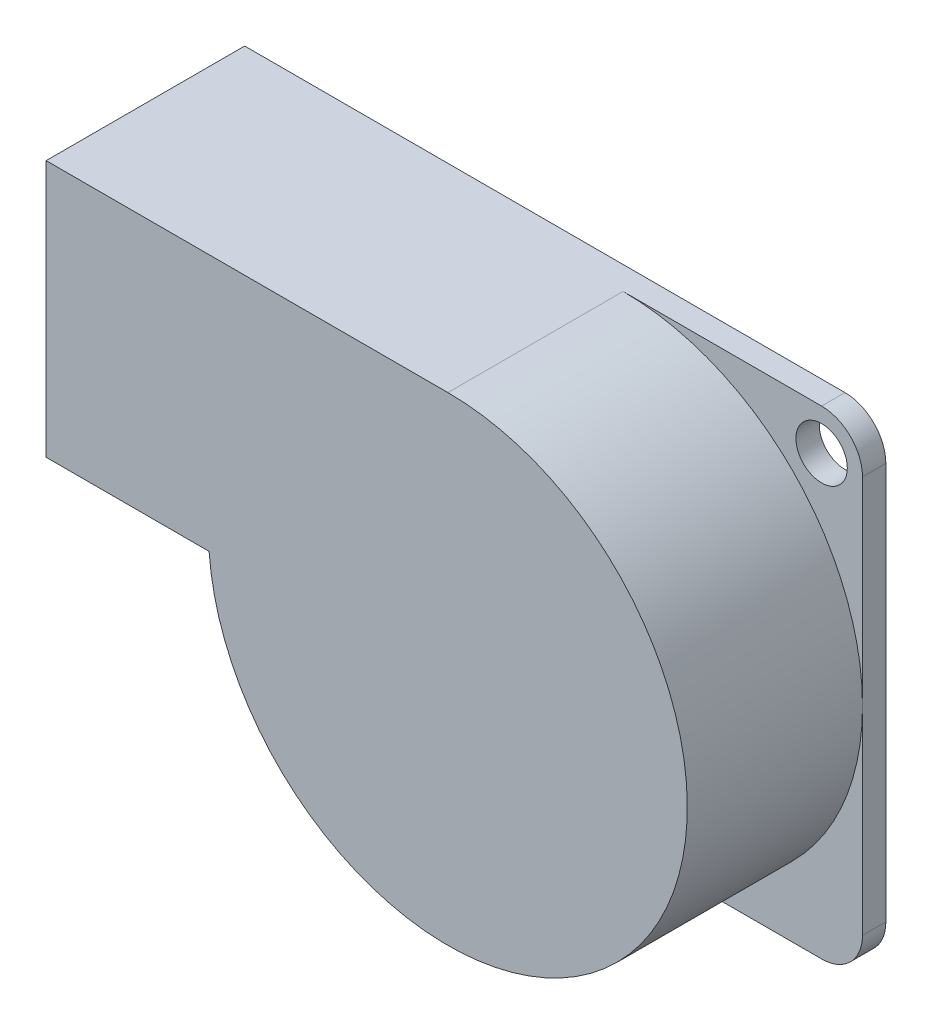
ISO-10303-21;
HEADER;
FILE_DESCRIPTION(('STEP AP214'),'2;1');
FILE_NAME('part.step','',(''),(''),'','','');
FILE_SCHEMA(('AUTOMOTIVE_DESIGN { 1 0 10303 214 1 1 1 1 }'));
ENDSEC;
DATA;
#1=APPLICATION_CONTEXT('core data for automotive mechanical design processes');
#2=APPLICATION_PROTOCOL_DEFINITION('international standard','automotive_design',2000,#1);
#3=PRODUCT_CONTEXT('',#1,'mechanical');
#4=PRODUCT('Part','Part','',(#3));
#5=PRODUCT_RELATED_PRODUCT_CATEGORY('part','',(#4));
#6=PRODUCT_DEFINITION_FORMATION('','',#4);
#7=PRODUCT_DEFINITION_CONTEXT('part definition',#1,'design');
#8=PRODUCT_DEFINITION('design','',#6,#7);
#9=PRODUCT_DEFINITION_SHAPE('','',#8);
#10=(LENGTH_UNIT() NAMED_UNIT(*) SI_UNIT(.MILLI.,.METRE.));
#11=(NAMED_UNIT(*) PLANE_ANGLE_UNIT() SI_UNIT($,.RADIAN.));
#12=(NAMED_UNIT(*) SI_UNIT($,.STERADIAN.) SOLID_ANGLE_UNIT());
#13=UNCERTAINTY_MEASURE_WITH_UNIT(LENGTH_MEASURE(1.E-05),#10,'distance_accuracy_value','');
#14=(GEOMETRIC_REPRESENTATION_CONTEXT(3) GLOBAL_UNCERTAINTY_ASSIGNED_CONTEXT((#13)) GLOBAL_UNIT_ASSIGNED_CONTEXT((#10,
#11,#12)) REPRESENTATION_CONTEXT('',''));
#15=CARTESIAN_POINT('',(0.,0.,0.));
#16=DIRECTION('',(0.,0.,1.));
#17=DIRECTION('',(1.,0.,0.));
#18=AXIS2_PLACEMENT_3D('',#15,#16,#17);
#19=CARTESIAN_POINT('',(-17.,-17.,1.));
#20=DIRECTION('',(0.,0.,1.));
#21=DIRECTION('',(1.,0.,0.));
#22=AXIS2_PLACEMENT_3D('',#19,#20,#21);
#23=PLANE('',#22);
#24=CARTESIAN_POINT('',(-8.5,-8.5,1.));
#25=DIRECTION('',(0.,0.,1.));
#26=DIRECTION('',(1.,0.,0.));
#27=AXIS2_PLACEMENT_3D('',#24,#25,#26);
#28=CIRCLE('',#27,10.25);
#29=CARTESIAN_POINT('',(1.75,-8.5,1.));
#30=VERTEX_POINT('',#29);
#31=CARTESIAN_POINT('',(-8.5,1.75,1.));
#32=VERTEX_POINT('',#31);
#33=EDGE_CURVE('E12',#30,#32,#28,.T.);
#34=ORIENTED_EDGE('',*,*,#33,.F.);
#35=DIRECTION('',(0.,1.,0.));
#36=VECTOR('',#35,1.);
#37=CARTESIAN_POINT('',(1.75,-17.,1.));
#38=LINE('',#37,#36);
#39=CARTESIAN_POINT('',(1.75,0.,1.));
#40=VERTEX_POINT('',#39);
#41=EDGE_CURVE('E175',#30,#40,#38,.T.);
#42=ORIENTED_EDGE('',*,*,#41,.T.);
#43=CARTESIAN_POINT('',(0.,0.,1.));
#44=DIRECTION('',(0.,0.,1.));
#45=DIRECTION('',(-1.,0.,0.));
#46=AXIS2_PLACEMENT_3D('',#43,#44,#45);
#47=CIRCLE('',#46,1.75);
#48=CARTESIAN_POINT('',(0.,1.75,1.));
#49=VERTEX_POINT('',#48);
#50=EDGE_CURVE('E179',#40,#49,#47,.T.);
#51=ORIENTED_EDGE('',*,*,#50,.T.);
#52=DIRECTION('',(-1.,0.,0.));
#53=VECTOR('',#52,1.);
#54=CARTESIAN_POINT('',(0.,1.75,1.));
#55=LINE('',#54,#53);
#56=EDGE_CURVE('E52',#49,#32,#55,.T.);
#57=ORIENTED_EDGE('',*,*,#56,.T.);
#58=EDGE_LOOP('',(#34,#42,#51,#57));
#59=FACE_BOUND('',#58,.T.);
#60=CARTESIAN_POINT('',(0.,0.,1.));
#61=DIRECTION('',(0.,0.,1.));
#62=DIRECTION('',(1.,0.,0.));
#63=AXIS2_PLACEMENT_3D('',#60,#61,#62);
#64=CIRCLE('',#63,1.1);
#65=CARTESIAN_POINT('',(1.1,0.,1.));
#66=VERTEX_POINT('',#65);
#67=EDGE_CURVE('E160',#66,#66,#64,.T.);
#68=ORIENTED_EDGE('',*,*,#67,.F.);
#69=EDGE_LOOP('',(#68));
#70=FACE_BOUND('',#69,.T.);
#71=ADVANCED_FACE('F35',(#59,#70),#23,.T.);
#72=CARTESIAN_POINT('',(-8.5,-18.75,1.));
#73=VERTEX_POINT('',#72);
#74=EDGE_CURVE('E44',#73,#30,#28,.T.);
#75=ORIENTED_EDGE('',*,*,#74,.F.);
#76=DIRECTION('',(1.,0.,0.));
#77=VECTOR('',#76,1.);
#78=CARTESIAN_POINT('',(-17.,-18.75,1.));
#79=LINE('',#78,#77);
#80=CARTESIAN_POINT('',(0.,-18.75,1.));
#81=VERTEX_POINT('',#80);
#82=EDGE_CURVE('E168',#73,#81,#79,.T.);
#83=ORIENTED_EDGE('',*,*,#82,.T.);
#84=CARTESIAN_POINT('',(0.,-17.,1.));
#85=DIRECTION('',(0.,0.,1.));
#86=DIRECTION('',(1.,0.,0.));
#87=AXIS2_PLACEMENT_3D('',#84,#85,#86);
#88=CIRCLE('',#87,1.75);
#89=CARTESIAN_POINT('',(1.75,-17.,1.));
#90=VERTEX_POINT('',#89);
#91=EDGE_CURVE('E173',#81,#90,#88,.T.);
#92=ORIENTED_EDGE('',*,*,#91,.T.);
#93=EDGE_CURVE('E176',#90,#30,#38,.T.);
#94=ORIENTED_EDGE('',*,*,#93,.T.);
#95=EDGE_LOOP('',(#75,#83,#92,#94));
#96=FACE_BOUND('',#95,.T.);
#97=ADVANCED_FACE('F280',(#96),#23,.T.);
#98=CARTESIAN_POINT('',(-18.7225241501304,-9.25,1.));
#99=VERTEX_POINT('',#98);
#100=EDGE_CURVE('E131',#99,#73,#28,.T.);
#101=ORIENTED_EDGE('',*,*,#100,.F.);
#102=DIRECTION('',(1.,0.,0.));
#103=VECTOR('',#102,1.);
#104=CARTESIAN_POINT('',(-25.7,-9.25,1.));
#105=LINE('',#104,#103);
#106=CARTESIAN_POINT('',(-18.75,-9.25,1.));
#107=VERTEX_POINT('',#106);
#108=EDGE_CURVE('E191',#107,#99,#105,.T.);
#109=ORIENTED_EDGE('',*,*,#108,.F.);
#110=DIRECTION('',(0.,-1.,0.));
#111=VECTOR('',#110,1.);
#112=CARTESIAN_POINT('',(-18.75,-9.25,1.));
#113=LINE('',#112,#111);
#114=CARTESIAN_POINT('',(-18.75,-17.,1.));
#115=VERTEX_POINT('',#114);
#116=EDGE_CURVE('E169',#107,#115,#113,.T.);
#117=ORIENTED_EDGE('',*,*,#116,.T.);
#118=CARTESIAN_POINT('',(-17.,-17.,1.));
#119=DIRECTION('',(0.,0.,1.));
#120=DIRECTION('',(1.,0.,0.));
#121=AXIS2_PLACEMENT_3D('',#118,#119,#120);
#122=CIRCLE('',#121,1.75);
#123=CARTESIAN_POINT('',(-17.,-18.75,1.));
#124=VERTEX_POINT('',#123);
#125=EDGE_CURVE('E166',#115,#124,#122,.T.);
#126=ORIENTED_EDGE('',*,*,#125,.T.);
#127=EDGE_CURVE('E170',#124,#73,#79,.T.);
#128=ORIENTED_EDGE('',*,*,#127,.T.);
#129=EDGE_LOOP('',(#101,#109,#117,#126,#128));
#130=FACE_BOUND('',#129,.T.);
#131=CARTESIAN_POINT('',(-17.,-17.,1.));
#132=DIRECTION('',(0.,0.,1.));
#133=DIRECTION('',(1.,0.,0.));
#134=AXIS2_PLACEMENT_3D('',#131,#132,#133);
#135=CIRCLE('',#134,1.1);
#136=CARTESIAN_POINT('',(-15.9,-17.,1.));
#137=VERTEX_POINT('',#136);
#138=EDGE_CURVE('E148',#137,#137,#135,.T.);
#139=ORIENTED_EDGE('',*,*,#138,.F.);
#140=EDGE_LOOP('',(#139));
#141=FACE_BOUND('',#140,.T.);
#142=ADVANCED_FACE('F282',(#130,#141),#23,.T.);
#143=CARTESIAN_POINT('',(-17.,-17.,0.));
#144=DIRECTION('',(0.,0.,1.));
#145=DIRECTION('',(1.,0.,0.));
#146=AXIS2_PLACEMENT_3D('',#143,#144,#145);
#147=PLANE('',#146);
#148=CARTESIAN_POINT('',(0.,0.,0.));
#149=DIRECTION('',(0.,0.,1.));
#150=DIRECTION('',(1.,0.,0.));
#151=AXIS2_PLACEMENT_3D('',#148,#149,#150);
#152=CIRCLE('',#151,1.1);
#153=CARTESIAN_POINT('',(1.1,0.,0.));
#154=VERTEX_POINT('',#153);
#155=EDGE_CURVE('E158',#154,#154,#152,.T.);
#156=ORIENTED_EDGE('',*,*,#155,.T.);
#157=EDGE_LOOP('',(#156));
#158=FACE_BOUND('',#157,.T.);
#159=DIRECTION('',(0.,-1.,0.));
#160=VECTOR('',#159,1.);
#161=CARTESIAN_POINT('',(-25.7,1.75,0.));
#162=LINE('',#161,#160);
#163=CARTESIAN_POINT('',(-25.7,1.75,0.));
#164=VERTEX_POINT('',#163);
#165=CARTESIAN_POINT('',(-25.7,-9.25,0.));
#166=VERTEX_POINT('',#165);
#167=EDGE_CURVE('E163',#164,#166,#162,.T.);
#168=ORIENTED_EDGE('',*,*,#167,.F.);
#169=DIRECTION('',(-1.,0.,0.));
#170=VECTOR('',#169,1.);
#171=CARTESIAN_POINT('',(0.,1.75,0.));
#172=LINE('',#171,#170);
#173=CARTESIAN_POINT('',(0.,1.75,0.));
#174=VERTEX_POINT('',#173);
#175=EDGE_CURVE('E201',#174,#164,#172,.T.);
#176=ORIENTED_EDGE('',*,*,#175,.F.);
#177=CARTESIAN_POINT('',(0.,0.,0.));
#178=DIRECTION('',(0.,0.,1.));
#179=DIRECTION('',(-1.,0.,0.));
#180=AXIS2_PLACEMENT_3D('',#177,#178,#179);
#181=CIRCLE('',#180,1.75);
#182=CARTESIAN_POINT('',(1.75,0.,0.));
#183=VERTEX_POINT('',#182);
#184=EDGE_CURVE('E206',#183,#174,#181,.T.);
#185=ORIENTED_EDGE('',*,*,#184,.F.);
#186=DIRECTION('',(0.,1.,0.));
#187=VECTOR('',#186,1.);
#188=CARTESIAN_POINT('',(1.75,-17.,0.));
#189=LINE('',#188,#187);
#190=CARTESIAN_POINT('',(1.75,-17.,0.));
#191=VERTEX_POINT('',#190);
#192=EDGE_CURVE('E210',#191,#183,#189,.T.);
#193=ORIENTED_EDGE('',*,*,#192,.F.);
#194=CARTESIAN_POINT('',(0.,-17.,0.));
#195=DIRECTION('',(0.,0.,1.));
#196=DIRECTION('',(1.,0.,0.));
#197=AXIS2_PLACEMENT_3D('',#194,#195,#196);
#198=CIRCLE('',#197,1.75);
#199=CARTESIAN_POINT('',(0.,-18.75,0.));
#200=VERTEX_POINT('',#199);
#201=EDGE_CURVE('E246',#200,#191,#198,.T.);
#202=ORIENTED_EDGE('',*,*,#201,.F.);
#203=DIRECTION('',(1.,0.,0.));
#204=VECTOR('',#203,1.);
#205=CARTESIAN_POINT('',(-17.,-18.75,0.));
#206=LINE('',#205,#204);
#207=CARTESIAN_POINT('',(-17.,-18.75,0.));
#208=VERTEX_POINT('',#207);
#209=EDGE_CURVE('E244',#208,#200,#206,.T.);
#210=ORIENTED_EDGE('',*,*,#209,.F.);
#211=CARTESIAN_POINT('',(-17.,-17.,0.));
#212=DIRECTION('',(0.,0.,1.));
#213=DIRECTION('',(1.,0.,0.));
#214=AXIS2_PLACEMENT_3D('',#211,#212,#213);
#215=CIRCLE('',#214,1.75);
#216=CARTESIAN_POINT('',(-18.75,-17.,0.));
#217=VERTEX_POINT('',#216);
#218=EDGE_CURVE('E234',#217,#208,#215,.T.);
#219=ORIENTED_EDGE('',*,*,#218,.F.);
#220=DIRECTION('',(0.,-1.,0.));
#221=VECTOR('',#220,1.);
#222=CARTESIAN_POINT('',(-18.75,-9.25,0.));
#223=LINE('',#222,#221);
#224=CARTESIAN_POINT('',(-18.75,-9.25,0.));
#225=VERTEX_POINT('',#224);
#226=EDGE_CURVE('E242',#225,#217,#223,.T.);
#227=ORIENTED_EDGE('',*,*,#226,.F.);
#228=DIRECTION('',(1.,0.,0.));
#229=VECTOR('',#228,1.);
#230=CARTESIAN_POINT('',(-25.7,-9.25,0.));
#231=LINE('',#230,#229);
#232=EDGE_CURVE('E248',#166,#225,#231,.T.);
#233=ORIENTED_EDGE('',*,*,#232,.F.);
#234=EDGE_LOOP('',(#168,#176,#185,#193,#202,#210,#219,#227,#233));
#235=FACE_BOUND('',#234,.T.);
#236=CARTESIAN_POINT('',(-17.,-17.,0.));
#237=DIRECTION('',(0.,0.,1.));
#238=DIRECTION('',(1.,0.,0.));
#239=AXIS2_PLACEMENT_3D('',#236,#237,#238);
#240=CIRCLE('',#239,1.1);
#241=CARTESIAN_POINT('',(-15.9,-17.,0.));
#242=VERTEX_POINT('',#241);
#243=EDGE_CURVE('E145',#242,#242,#240,.T.);
#244=ORIENTED_EDGE('',*,*,#243,.T.);
#245=EDGE_LOOP('',(#244));
#246=FACE_BOUND('',#245,.T.);
#247=ADVANCED_FACE('F240',(#158,#235,#246),#147,.F.);
#248=CARTESIAN_POINT('',(-25.7,1.75,1.));
#249=DIRECTION('',(1.,0.,0.));
#250=DIRECTION('',(0.,0.,-1.));
#251=AXIS2_PLACEMENT_3D('',#248,#249,#250);
#252=PLANE('',#251);
#253=ORIENTED_EDGE('',*,*,#167,.T.);
#254=DIRECTION('',(0.,0.,-1.));
#255=VECTOR('',#254,1.);
#256=CARTESIAN_POINT('',(-25.7,-9.25,1.));
#257=LINE('',#256,#255);
#258=CARTESIAN_POINT('',(-25.7,-9.25,8.5));
#259=VERTEX_POINT('',#258);
#260=EDGE_CURVE('E186',#259,#166,#257,.T.);
#261=ORIENTED_EDGE('',*,*,#260,.F.);
#262=DIRECTION('',(0.,-1.,0.));
#263=VECTOR('',#262,1.);
#264=CARTESIAN_POINT('',(-25.7,1.75,8.5));
#265=LINE('',#264,#263);
#266=CARTESIAN_POINT('',(-25.7,1.75,8.5));
#267=VERTEX_POINT('',#266);
#268=EDGE_CURVE('E139',#267,#259,#265,.T.);
#269=ORIENTED_EDGE('',*,*,#268,.F.);
#270=DIRECTION('',(0.,0.,-1.));
#271=VECTOR('',#270,1.);
#272=CARTESIAN_POINT('',(-25.7,1.75,1.));
#273=LINE('',#272,#271);
#274=EDGE_CURVE('E135',#267,#164,#273,.T.);
#275=ORIENTED_EDGE('',*,*,#274,.T.);
#276=EDGE_LOOP('',(#253,#261,#269,#275));
#277=FACE_BOUND('',#276,.T.);
#278=ADVANCED_FACE('F37',(#277),#252,.F.);
#279=CARTESIAN_POINT('',(-25.7,-9.25,1.));
#280=DIRECTION('',(0.,1.,0.));
#281=DIRECTION('',(0.,0.,1.));
#282=AXIS2_PLACEMENT_3D('',#279,#280,#281);
#283=PLANE('',#282);
#284=ORIENTED_EDGE('',*,*,#232,.T.);
#285=DIRECTION('',(0.,0.,-1.));
#286=VECTOR('',#285,1.);
#287=CARTESIAN_POINT('',(-18.75,-9.25,1.));
#288=LINE('',#287,#286);
#289=EDGE_CURVE('E194',#107,#225,#288,.T.);
#290=ORIENTED_EDGE('',*,*,#289,.F.);
#291=ORIENTED_EDGE('',*,*,#108,.T.);
#292=DIRECTION('',(0.,0.,-1.));
#293=VECTOR('',#292,1.);
#294=CARTESIAN_POINT('',(-18.7225241501304,-9.25,51.2600715118927));
#295=LINE('',#294,#293);
#296=CARTESIAN_POINT('',(-18.7225241501304,-9.25,8.5));
#297=VERTEX_POINT('',#296);
#298=EDGE_CURVE('E155',#297,#99,#295,.T.);
#299=ORIENTED_EDGE('',*,*,#298,.F.);
#300=DIRECTION('',(1.,0.,0.));
#301=VECTOR('',#300,1.);
#302=CARTESIAN_POINT('',(-25.7,-9.25,8.5));
#303=LINE('',#302,#301);
#304=EDGE_CURVE('E144',#259,#297,#303,.T.);
#305=ORIENTED_EDGE('',*,*,#304,.F.);
#306=ORIENTED_EDGE('',*,*,#260,.T.);
#307=EDGE_LOOP('',(#284,#290,#291,#299,#305,#306));
#308=FACE_BOUND('',#307,.T.);
#309=ADVANCED_FACE('F267',(#308),#283,.F.);
#310=CARTESIAN_POINT('',(-18.75,-9.25,1.));
#311=DIRECTION('',(1.,0.,0.));
#312=DIRECTION('',(0.,0.,-1.));
#313=AXIS2_PLACEMENT_3D('',#310,#311,#312);
#314=PLANE('',#313);
#315=ORIENTED_EDGE('',*,*,#226,.T.);
#316=DIRECTION('',(0.,0.,-1.));
#317=VECTOR('',#316,1.);
#318=CARTESIAN_POINT('',(-18.75,-17.,1.));
#319=LINE('',#318,#317);
#320=EDGE_CURVE('E197',#115,#217,#319,.T.);
#321=ORIENTED_EDGE('',*,*,#320,.F.);
#322=ORIENTED_EDGE('',*,*,#116,.F.);
#323=ORIENTED_EDGE('',*,*,#289,.T.);
#324=EDGE_LOOP('',(#315,#321,#322,#323));
#325=FACE_BOUND('',#324,.T.);
#326=ADVANCED_FACE('F268',(#325),#314,.F.);
#327=CARTESIAN_POINT('',(-17.,-17.,1.));
#328=DIRECTION('',(0.,0.,-1.));
#329=DIRECTION('',(-1.,0.,0.));
#330=AXIS2_PLACEMENT_3D('',#327,#328,#329);
#331=CYLINDRICAL_SURFACE('',#330,1.75);
#332=ORIENTED_EDGE('',*,*,#218,.T.);
#333=DIRECTION('',(0.,0.,-1.));
#334=VECTOR('',#333,1.);
#335=CARTESIAN_POINT('',(-17.,-18.75,1.));
#336=LINE('',#335,#334);
#337=EDGE_CURVE('E226',#124,#208,#336,.T.);
#338=ORIENTED_EDGE('',*,*,#337,.F.);
#339=ORIENTED_EDGE('',*,*,#125,.F.);
#340=ORIENTED_EDGE('',*,*,#320,.T.);
#341=EDGE_LOOP('',(#332,#338,#339,#340));
#342=FACE_BOUND('',#341,.T.);
#343=ADVANCED_FACE('F232',(#342),#331,.T.);
#344=CARTESIAN_POINT('',(-17.,-18.75,1.));
#345=DIRECTION('',(0.,1.,0.));
#346=DIRECTION('',(-1.,0.,0.));
#347=AXIS2_PLACEMENT_3D('',#344,#345,#346);
#348=PLANE('',#347);
#349=ORIENTED_EDGE('',*,*,#209,.T.);
#350=DIRECTION('',(0.,0.,-1.));
#351=VECTOR('',#350,1.);
#352=CARTESIAN_POINT('',(0.,-18.75,1.));
#353=LINE('',#352,#351);
#354=EDGE_CURVE('E223',#81,#200,#353,.T.);
#355=ORIENTED_EDGE('',*,*,#354,.F.);
#356=ORIENTED_EDGE('',*,*,#82,.F.);
#357=ORIENTED_EDGE('',*,*,#127,.F.);
#358=ORIENTED_EDGE('',*,*,#337,.T.);
#359=EDGE_LOOP('',(#349,#355,#356,#357,#358));
#360=FACE_BOUND('',#359,.T.);
#361=ADVANCED_FACE('F276',(#360),#348,.F.);
#362=CARTESIAN_POINT('',(0.,-17.,1.));
#363=DIRECTION('',(0.,0.,-1.));
#364=DIRECTION('',(-1.,0.,0.));
#365=AXIS2_PLACEMENT_3D('',#362,#363,#364);
#366=CYLINDRICAL_SURFACE('',#365,1.75);
#367=ORIENTED_EDGE('',*,*,#201,.T.);
#368=DIRECTION('',(0.,0.,-1.));
#369=VECTOR('',#368,1.);
#370=CARTESIAN_POINT('',(1.75,-17.,1.));
#371=LINE('',#370,#369);
#372=EDGE_CURVE('E220',#90,#191,#371,.T.);
#373=ORIENTED_EDGE('',*,*,#372,.F.);
#374=ORIENTED_EDGE('',*,*,#91,.F.);
#375=ORIENTED_EDGE('',*,*,#354,.T.);
#376=EDGE_LOOP('',(#367,#373,#374,#375));
#377=FACE_BOUND('',#376,.T.);
#378=ADVANCED_FACE('F373',(#377),#366,.T.);
#379=CARTESIAN_POINT('',(1.75,-17.,1.));
#380=DIRECTION('',(-1.,0.,0.));
#381=DIRECTION('',(0.,-1.,0.));
#382=AXIS2_PLACEMENT_3D('',#379,#380,#381);
#383=PLANE('',#382);
#384=ORIENTED_EDGE('',*,*,#192,.T.);
#385=DIRECTION('',(0.,0.,-1.));
#386=VECTOR('',#385,1.);
#387=CARTESIAN_POINT('',(1.75,0.,1.));
#388=LINE('',#387,#386);
#389=EDGE_CURVE('E217',#40,#183,#388,.T.);
#390=ORIENTED_EDGE('',*,*,#389,.F.);
#391=ORIENTED_EDGE('',*,*,#41,.F.);
#392=ORIENTED_EDGE('',*,*,#93,.F.);
#393=ORIENTED_EDGE('',*,*,#372,.T.);
#394=EDGE_LOOP('',(#384,#390,#391,#392,#393));
#395=FACE_BOUND('',#394,.T.);
#396=ADVANCED_FACE('F254',(#395),#383,.F.);
#397=CARTESIAN_POINT('',(0.,0.,1.));
#398=DIRECTION('',(0.,0.,-1.));
#399=DIRECTION('',(-1.,0.,0.));
#400=AXIS2_PLACEMENT_3D('',#397,#398,#399);
#401=CYLINDRICAL_SURFACE('',#400,1.75);
#402=ORIENTED_EDGE('',*,*,#184,.T.);
#403=DIRECTION('',(0.,0.,-1.));
#404=VECTOR('',#403,1.);
#405=CARTESIAN_POINT('',(0.,1.75,1.));
#406=LINE('',#405,#404);
#407=EDGE_CURVE('E215',#49,#174,#406,.T.);
#408=ORIENTED_EDGE('',*,*,#407,.F.);
#409=ORIENTED_EDGE('',*,*,#50,.F.);
#410=ORIENTED_EDGE('',*,*,#389,.T.);
#411=EDGE_LOOP('',(#402,#408,#409,#410));
#412=FACE_BOUND('',#411,.T.);
#413=ADVANCED_FACE('F260',(#412),#401,.T.);
#414=CARTESIAN_POINT('',(0.,1.75,1.));
#415=DIRECTION('',(0.,-1.,0.));
#416=DIRECTION('',(1.,0.,0.));
#417=AXIS2_PLACEMENT_3D('',#414,#415,#416);
#418=PLANE('',#417);
#419=ORIENTED_EDGE('',*,*,#175,.T.);
#420=ORIENTED_EDGE('',*,*,#274,.F.);
#421=DIRECTION('',(-1.,0.,0.));
#422=VECTOR('',#421,1.);
#423=CARTESIAN_POINT('',(-8.5,1.75,8.5));
#424=LINE('',#423,#422);
#425=CARTESIAN_POINT('',(-8.5,1.75,8.5));
#426=VERTEX_POINT('',#425);
#427=EDGE_CURVE('E130',#426,#267,#424,.T.);
#428=ORIENTED_EDGE('',*,*,#427,.F.);
#429=DIRECTION('',(0.,0.,-1.));
#430=VECTOR('',#429,1.);
#431=CARTESIAN_POINT('',(-8.5,1.75,51.2600715118927));
#432=LINE('',#431,#430);
#433=EDGE_CURVE('E121',#426,#32,#432,.T.);
#434=ORIENTED_EDGE('',*,*,#433,.T.);
#435=ORIENTED_EDGE('',*,*,#56,.F.);
#436=ORIENTED_EDGE('',*,*,#407,.T.);
#437=EDGE_LOOP('',(#419,#420,#428,#434,#435,#436));
#438=FACE_BOUND('',#437,.T.);
#439=ADVANCED_FACE('F133',(#438),#418,.F.);
#440=CARTESIAN_POINT('',(0.,0.,1.));
#441=DIRECTION('',(0.,0.,-1.));
#442=DIRECTION('',(-1.,0.,0.));
#443=AXIS2_PLACEMENT_3D('',#440,#441,#442);
#444=CYLINDRICAL_SURFACE('',#443,1.1);
#445=ORIENTED_EDGE('',*,*,#67,.T.);
#446=EDGE_LOOP('',(#445));
#447=FACE_BOUND('',#446,.T.);
#448=ORIENTED_EDGE('',*,*,#155,.F.);
#449=EDGE_LOOP('',(#448));
#450=FACE_BOUND('',#449,.T.);
#451=ADVANCED_FACE('F304',(#447,#450),#444,.F.);
#452=CARTESIAN_POINT('',(-17.,-17.,1.));
#453=DIRECTION('',(0.,0.,-1.));
#454=DIRECTION('',(-1.,0.,0.));
#455=AXIS2_PLACEMENT_3D('',#452,#453,#454);
#456=CYLINDRICAL_SURFACE('',#455,1.1);
#457=ORIENTED_EDGE('',*,*,#138,.T.);
#458=EDGE_LOOP('',(#457));
#459=FACE_BOUND('',#458,.T.);
#460=ORIENTED_EDGE('',*,*,#243,.F.);
#461=EDGE_LOOP('',(#460));
#462=FACE_BOUND('',#461,.T.);
#463=ADVANCED_FACE('F301',(#459,#462),#456,.F.);
#464=CARTESIAN_POINT('',(-8.5,-8.5,51.2600715118927));
#465=DIRECTION('',(0.,0.,-1.));
#466=DIRECTION('',(-1.,0.,0.));
#467=AXIS2_PLACEMENT_3D('',#464,#465,#466);
#468=CYLINDRICAL_SURFACE('',#467,10.25);
#469=CARTESIAN_POINT('',(-8.5,-8.5,8.5));
#470=DIRECTION('',(0.,0.,1.));
#471=DIRECTION('',(1.,0.,0.));
#472=AXIS2_PLACEMENT_3D('',#469,#470,#471);
#473=CIRCLE('',#472,10.25);
#474=EDGE_CURVE('E126',#297,#426,#473,.T.);
#475=ORIENTED_EDGE('',*,*,#474,.F.);
#476=ORIENTED_EDGE('',*,*,#298,.T.);
#477=ORIENTED_EDGE('',*,*,#100,.T.);
#478=ORIENTED_EDGE('',*,*,#74,.T.);
#479=ORIENTED_EDGE('',*,*,#33,.T.);
#480=ORIENTED_EDGE('',*,*,#433,.F.);
#481=EDGE_LOOP('',(#475,#476,#477,#478,#479,#480));
#482=FACE_BOUND('',#481,.T.);
#483=ADVANCED_FACE('F123',(#482),#468,.T.);
#484=CARTESIAN_POINT('',(-17.,-17.,8.5));
#485=DIRECTION('',(0.,0.,1.));
#486=DIRECTION('',(1.,0.,0.));
#487=AXIS2_PLACEMENT_3D('',#484,#485,#486);
#488=PLANE('',#487);
#489=ORIENTED_EDGE('',*,*,#427,.T.);
#490=ORIENTED_EDGE('',*,*,#268,.T.);
#491=ORIENTED_EDGE('',*,*,#304,.T.);
#492=ORIENTED_EDGE('',*,*,#474,.T.);
#493=EDGE_LOOP('',(#489,#490,#491,#492));
#494=FACE_BOUND('',#493,.T.);
#495=ADVANCED_FACE('F142',(#494),#488,.T.);
#496=CLOSED_SHELL('',(#71,#97,#142,#247,#278,#309,#326,#343,#361,#378,#396,#413,#439,#451,#463,
#483,#495));
#497=MANIFOLD_SOLID_BREP('B2',#496);
#498=ADVANCED_BREP_SHAPE_REPRESENTATION('',(#18,#497),#14);
#499=SHAPE_DEFINITION_REPRESENTATION(#9,#498);
ENDSEC;
END-ISO-10303-21;
